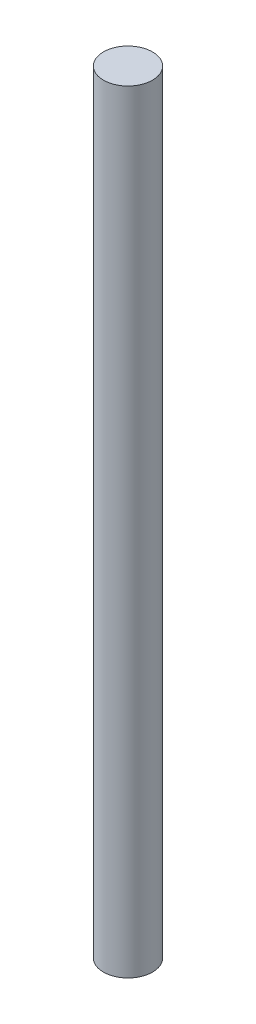
ISO-10303-21;
HEADER;
FILE_DESCRIPTION(('STEP AP214'),'2;1');
FILE_NAME('part.step','',(''),(''),'','','');
FILE_SCHEMA(('AUTOMOTIVE_DESIGN { 1 0 10303 214 1 1 1 1 }'));
ENDSEC;
DATA;
#1=APPLICATION_CONTEXT('core data for automotive mechanical design processes');
#2=APPLICATION_PROTOCOL_DEFINITION('international standard','automotive_design',2000,#1);
#3=PRODUCT_CONTEXT('',#1,'mechanical');
#4=PRODUCT('Part','Part','',(#3));
#5=PRODUCT_RELATED_PRODUCT_CATEGORY('part','',(#4));
#6=PRODUCT_DEFINITION_FORMATION('','',#4);
#7=PRODUCT_DEFINITION_CONTEXT('part definition',#1,'design');
#8=PRODUCT_DEFINITION('design','',#6,#7);
#9=PRODUCT_DEFINITION_SHAPE('','',#8);
#10=(LENGTH_UNIT() NAMED_UNIT(*) SI_UNIT(.MILLI.,.METRE.));
#11=(NAMED_UNIT(*) PLANE_ANGLE_UNIT() SI_UNIT($,.RADIAN.));
#12=(NAMED_UNIT(*) SI_UNIT($,.STERADIAN.) SOLID_ANGLE_UNIT());
#13=UNCERTAINTY_MEASURE_WITH_UNIT(LENGTH_MEASURE(1.E-05),#10,'distance_accuracy_value','');
#14=(GEOMETRIC_REPRESENTATION_CONTEXT(3) GLOBAL_UNCERTAINTY_ASSIGNED_CONTEXT((#13)) GLOBAL_UNIT_ASSIGNED_CONTEXT((#10,
#11,#12)) REPRESENTATION_CONTEXT('',''));
#15=CARTESIAN_POINT('',(0.,0.,0.));
#16=DIRECTION('',(0.,0.,1.));
#17=DIRECTION('',(1.,0.,0.));
#18=AXIS2_PLACEMENT_3D('',#15,#16,#17);
#19=CARTESIAN_POINT('',(0.,126.,0.));
#20=DIRECTION('',(0.,-1.,0.));
#21=DIRECTION('',(0.,0.,-1.));
#22=AXIS2_PLACEMENT_3D('',#19,#20,#21);
#23=CYLINDRICAL_SURFACE('',#22,4.);
#24=CARTESIAN_POINT('',(0.,126.,0.));
#25=DIRECTION('',(0.,1.,0.));
#26=DIRECTION('',(0.,0.,1.));
#27=AXIS2_PLACEMENT_3D('',#24,#25,#26);
#28=CIRCLE('',#27,4.);
#29=CARTESIAN_POINT('',(0.,126.,4.));
#30=VERTEX_POINT('',#29);
#31=EDGE_CURVE('E10',#30,#30,#28,.T.);
#32=ORIENTED_EDGE('',*,*,#31,.F.);
#33=EDGE_LOOP('',(#32));
#34=FACE_BOUND('',#33,.T.);
#35=CARTESIAN_POINT('',(0.,0.,0.));
#36=DIRECTION('',(0.,1.,0.));
#37=DIRECTION('',(0.,0.,1.));
#38=AXIS2_PLACEMENT_3D('',#35,#36,#37);
#39=CIRCLE('',#38,4.);
#40=CARTESIAN_POINT('',(0.,0.,4.));
#41=VERTEX_POINT('',#40);
#42=EDGE_CURVE('E36',#41,#41,#39,.T.);
#43=ORIENTED_EDGE('',*,*,#42,.T.);
#44=EDGE_LOOP('',(#43));
#45=FACE_BOUND('',#44,.T.);
#46=ADVANCED_FACE('F33',(#34,#45),#23,.T.);
#47=CARTESIAN_POINT('',(0.,126.,0.));
#48=DIRECTION('',(0.,1.,0.));
#49=DIRECTION('',(0.,0.,1.));
#50=AXIS2_PLACEMENT_3D('',#47,#48,#49);
#51=PLANE('',#50);
#52=ORIENTED_EDGE('',*,*,#31,.T.);
#53=EDGE_LOOP('',(#52));
#54=FACE_BOUND('',#53,.T.);
#55=ADVANCED_FACE('F48',(#54),#51,.T.);
#56=CARTESIAN_POINT('',(0.,0.,0.));
#57=DIRECTION('',(0.,1.,0.));
#58=DIRECTION('',(0.,0.,1.));
#59=AXIS2_PLACEMENT_3D('',#56,#57,#58);
#60=PLANE('',#59);
#61=ORIENTED_EDGE('',*,*,#42,.F.);
#62=EDGE_LOOP('',(#61));
#63=FACE_BOUND('',#62,.T.);
#64=ADVANCED_FACE('F46',(#63),#60,.F.);
#65=CLOSED_SHELL('',(#46,#55,#64));
#66=MANIFOLD_SOLID_BREP('B2',#65);
#67=ADVANCED_BREP_SHAPE_REPRESENTATION('',(#18,#66),#14);
#68=SHAPE_DEFINITION_REPRESENTATION(#9,#67);
ENDSEC;
END-ISO-10303-21;
